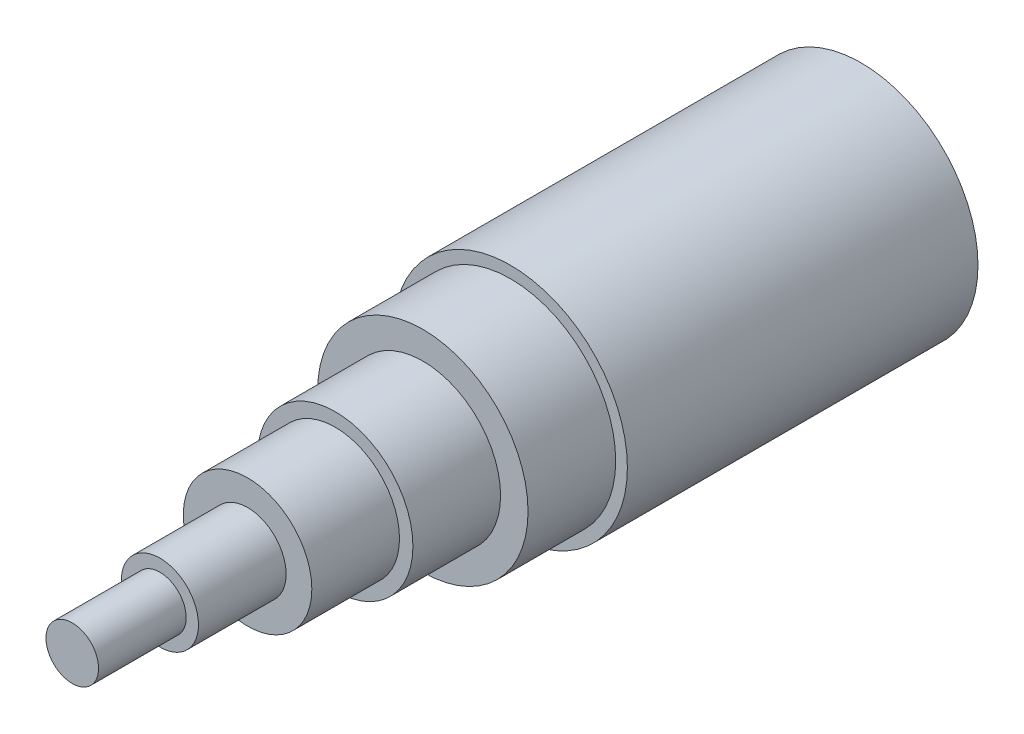
ISO-10303-21;
HEADER;
FILE_DESCRIPTION(('STEP AP214'),'2;1');
FILE_NAME('part.step','',(''),(''),'','','');
FILE_SCHEMA(('AUTOMOTIVE_DESIGN { 1 0 10303 214 1 1 1 1 }'));
ENDSEC;
DATA;
#1=APPLICATION_CONTEXT('core data for automotive mechanical design processes');
#2=APPLICATION_PROTOCOL_DEFINITION('international standard','automotive_design',2000,#1);
#3=PRODUCT_CONTEXT('',#1,'mechanical');
#4=PRODUCT('Part','Part','',(#3));
#5=PRODUCT_RELATED_PRODUCT_CATEGORY('part','',(#4));
#6=PRODUCT_DEFINITION_FORMATION('','',#4);
#7=PRODUCT_DEFINITION_CONTEXT('part definition',#1,'design');
#8=PRODUCT_DEFINITION('design','',#6,#7);
#9=PRODUCT_DEFINITION_SHAPE('','',#8);
#10=(LENGTH_UNIT() NAMED_UNIT(*) SI_UNIT(.MILLI.,.METRE.));
#11=(NAMED_UNIT(*) PLANE_ANGLE_UNIT() SI_UNIT($,.RADIAN.));
#12=(NAMED_UNIT(*) SI_UNIT($,.STERADIAN.) SOLID_ANGLE_UNIT());
#13=UNCERTAINTY_MEASURE_WITH_UNIT(LENGTH_MEASURE(1.E-05),#10,'distance_accuracy_value','');
#14=(GEOMETRIC_REPRESENTATION_CONTEXT(3) GLOBAL_UNCERTAINTY_ASSIGNED_CONTEXT((#13)) GLOBAL_UNIT_ASSIGNED_CONTEXT((#10,
#11,#12)) REPRESENTATION_CONTEXT('',''));
#15=CARTESIAN_POINT('',(0.,0.,0.));
#16=DIRECTION('',(0.,0.,1.));
#17=DIRECTION('',(1.,0.,0.));
#18=AXIS2_PLACEMENT_3D('',#15,#16,#17);
#19=CARTESIAN_POINT('',(0.,0.,6.));
#20=DIRECTION('',(0.,0.,-1.));
#21=DIRECTION('',(-1.,0.,0.));
#22=AXIS2_PLACEMENT_3D('',#19,#20,#21);
#23=CYLINDRICAL_SURFACE('',#22,0.33);
#24=CARTESIAN_POINT('',(0.,0.,5.25));
#25=DIRECTION('',(0.,0.,1.));
#26=DIRECTION('',(1.,0.,0.));
#27=AXIS2_PLACEMENT_3D('',#24,#25,#26);
#28=CIRCLE('',#27,0.33);
#29=CARTESIAN_POINT('',(0.33,0.,5.25));
#30=VERTEX_POINT('',#29);
#31=EDGE_CURVE('E65',#30,#30,#28,.T.);
#32=ORIENTED_EDGE('',*,*,#31,.T.);
#33=EDGE_LOOP('',(#32));
#34=FACE_BOUND('',#33,.T.);
#35=CARTESIAN_POINT('',(0.,0.,6.));
#36=DIRECTION('',(0.,0.,1.));
#37=DIRECTION('',(1.,0.,0.));
#38=AXIS2_PLACEMENT_3D('',#35,#36,#37);
#39=CIRCLE('',#38,0.33);
#40=CARTESIAN_POINT('',(0.33,0.,6.));
#41=VERTEX_POINT('',#40);
#42=EDGE_CURVE('E52',#41,#41,#39,.T.);
#43=ORIENTED_EDGE('',*,*,#42,.F.);
#44=EDGE_LOOP('',(#43));
#45=FACE_BOUND('',#44,.T.);
#46=ADVANCED_FACE('F39',(#34,#45),#23,.T.);
#47=CARTESIAN_POINT('',(0.,0.,6.));
#48=DIRECTION('',(0.,0.,1.));
#49=DIRECTION('',(1.,0.,0.));
#50=AXIS2_PLACEMENT_3D('',#47,#48,#49);
#51=PLANE('',#50);
#52=CARTESIAN_POINT('',(0.,0.,6.));
#53=DIRECTION('',(0.,0.,1.));
#54=DIRECTION('',(1.,0.,0.));
#55=AXIS2_PLACEMENT_3D('',#52,#53,#54);
#56=CIRCLE('',#55,0.225);
#57=CARTESIAN_POINT('',(0.225,0.,6.));
#58=VERTEX_POINT('',#57);
#59=EDGE_CURVE('E57',#58,#58,#56,.T.);
#60=ORIENTED_EDGE('',*,*,#59,.F.);
#61=EDGE_LOOP('',(#60));
#62=FACE_BOUND('',#61,.T.);
#63=ORIENTED_EDGE('',*,*,#42,.T.);
#64=EDGE_LOOP('',(#63));
#65=FACE_BOUND('',#64,.T.);
#66=ADVANCED_FACE('F110',(#62,#65),#51,.T.);
#67=CARTESIAN_POINT('',(0.,0.,5.25));
#68=DIRECTION('',(0.,0.,-1.));
#69=DIRECTION('',(-1.,0.,0.));
#70=AXIS2_PLACEMENT_3D('',#67,#68,#69);
#71=CYLINDRICAL_SURFACE('',#70,0.55);
#72=CARTESIAN_POINT('',(0.,0.,4.5));
#73=DIRECTION('',(0.,0.,1.));
#74=DIRECTION('',(1.,0.,0.));
#75=AXIS2_PLACEMENT_3D('',#72,#73,#74);
#76=CIRCLE('',#75,0.55);
#77=CARTESIAN_POINT('',(0.55,0.,4.5));
#78=VERTEX_POINT('',#77);
#79=EDGE_CURVE('E73',#78,#78,#76,.T.);
#80=ORIENTED_EDGE('',*,*,#79,.T.);
#81=EDGE_LOOP('',(#80));
#82=FACE_BOUND('',#81,.T.);
#83=CARTESIAN_POINT('',(0.,0.,5.25));
#84=DIRECTION('',(0.,0.,1.));
#85=DIRECTION('',(1.,0.,0.));
#86=AXIS2_PLACEMENT_3D('',#83,#84,#85);
#87=CIRCLE('',#86,0.55);
#88=CARTESIAN_POINT('',(0.55,0.,5.25));
#89=VERTEX_POINT('',#88);
#90=EDGE_CURVE('E61',#89,#89,#87,.T.);
#91=ORIENTED_EDGE('',*,*,#90,.F.);
#92=EDGE_LOOP('',(#91));
#93=FACE_BOUND('',#92,.T.);
#94=ADVANCED_FACE('F116',(#82,#93),#71,.T.);
#95=CARTESIAN_POINT('',(0.,0.,5.25));
#96=DIRECTION('',(0.,0.,1.));
#97=DIRECTION('',(1.,0.,0.));
#98=AXIS2_PLACEMENT_3D('',#95,#96,#97);
#99=PLANE('',#98);
#100=ORIENTED_EDGE('',*,*,#31,.F.);
#101=EDGE_LOOP('',(#100));
#102=FACE_BOUND('',#101,.T.);
#103=ORIENTED_EDGE('',*,*,#90,.T.);
#104=EDGE_LOOP('',(#103));
#105=FACE_BOUND('',#104,.T.);
#106=ADVANCED_FACE('F149',(#102,#105),#99,.T.);
#107=CARTESIAN_POINT('',(0.,0.,4.5));
#108=DIRECTION('',(0.,0.,-1.));
#109=DIRECTION('',(-1.,0.,0.));
#110=AXIS2_PLACEMENT_3D('',#107,#108,#109);
#111=CYLINDRICAL_SURFACE('',#110,0.665);
#112=CARTESIAN_POINT('',(0.,0.,3.75));
#113=DIRECTION('',(0.,0.,1.));
#114=DIRECTION('',(1.,0.,0.));
#115=AXIS2_PLACEMENT_3D('',#112,#113,#114);
#116=CIRCLE('',#115,0.665);
#117=CARTESIAN_POINT('',(0.665,0.,3.75));
#118=VERTEX_POINT('',#117);
#119=EDGE_CURVE('E82',#118,#118,#116,.T.);
#120=ORIENTED_EDGE('',*,*,#119,.T.);
#121=EDGE_LOOP('',(#120));
#122=FACE_BOUND('',#121,.T.);
#123=CARTESIAN_POINT('',(0.,0.,4.5));
#124=DIRECTION('',(0.,0.,1.));
#125=DIRECTION('',(1.,0.,0.));
#126=AXIS2_PLACEMENT_3D('',#123,#124,#125);
#127=CIRCLE('',#126,0.665);
#128=CARTESIAN_POINT('',(0.665,0.,4.5));
#129=VERTEX_POINT('',#128);
#130=EDGE_CURVE('E69',#129,#129,#127,.T.);
#131=ORIENTED_EDGE('',*,*,#130,.F.);
#132=EDGE_LOOP('',(#131));
#133=FACE_BOUND('',#132,.T.);
#134=ADVANCED_FACE('F145',(#122,#133),#111,.T.);
#135=CARTESIAN_POINT('',(0.,0.,4.5));
#136=DIRECTION('',(0.,0.,1.));
#137=DIRECTION('',(1.,0.,0.));
#138=AXIS2_PLACEMENT_3D('',#135,#136,#137);
#139=PLANE('',#138);
#140=ORIENTED_EDGE('',*,*,#79,.F.);
#141=EDGE_LOOP('',(#140));
#142=FACE_BOUND('',#141,.T.);
#143=ORIENTED_EDGE('',*,*,#130,.T.);
#144=EDGE_LOOP('',(#143));
#145=FACE_BOUND('',#144,.T.);
#146=ADVANCED_FACE('F137',(#142,#145),#139,.T.);
#147=CARTESIAN_POINT('',(0.,0.,3.75));
#148=DIRECTION('',(0.,0.,-1.));
#149=DIRECTION('',(-1.,0.,0.));
#150=AXIS2_PLACEMENT_3D('',#147,#148,#149);
#151=CYLINDRICAL_SURFACE('',#150,0.9);
#152=CARTESIAN_POINT('',(0.,0.,3.75));
#153=DIRECTION('',(0.,0.,1.));
#154=DIRECTION('',(1.,0.,0.));
#155=AXIS2_PLACEMENT_3D('',#152,#153,#154);
#156=CIRCLE('',#155,0.9);
#157=CARTESIAN_POINT('',(0.9,0.,3.75));
#158=VERTEX_POINT('',#157);
#159=EDGE_CURVE('E77',#158,#158,#156,.T.);
#160=ORIENTED_EDGE('',*,*,#159,.F.);
#161=EDGE_LOOP('',(#160));
#162=FACE_BOUND('',#161,.T.);
#163=CARTESIAN_POINT('',(0.,0.,3.));
#164=DIRECTION('',(0.,0.,1.));
#165=DIRECTION('',(1.,0.,0.));
#166=AXIS2_PLACEMENT_3D('',#163,#164,#165);
#167=CIRCLE('',#166,0.9);
#168=CARTESIAN_POINT('',(0.9,0.,3.));
#169=VERTEX_POINT('',#168);
#170=EDGE_CURVE('E78',#169,#169,#167,.T.);
#171=ORIENTED_EDGE('',*,*,#170,.T.);
#172=EDGE_LOOP('',(#171));
#173=FACE_BOUND('',#172,.T.);
#174=ADVANCED_FACE('F130',(#162,#173),#151,.T.);
#175=CARTESIAN_POINT('',(0.,0.,3.75));
#176=DIRECTION('',(0.,0.,1.));
#177=DIRECTION('',(1.,0.,0.));
#178=AXIS2_PLACEMENT_3D('',#175,#176,#177);
#179=PLANE('',#178);
#180=ORIENTED_EDGE('',*,*,#119,.F.);
#181=EDGE_LOOP('',(#180));
#182=FACE_BOUND('',#181,.T.);
#183=ORIENTED_EDGE('',*,*,#159,.T.);
#184=EDGE_LOOP('',(#183));
#185=FACE_BOUND('',#184,.T.);
#186=ADVANCED_FACE('F123',(#182,#185),#179,.T.);
#187=CARTESIAN_POINT('',(0.,0.,0.));
#188=DIRECTION('',(0.,0.,1.));
#189=DIRECTION('',(1.,0.,0.));
#190=AXIS2_PLACEMENT_3D('',#187,#188,#189);
#191=PLANE('',#190);
#192=CARTESIAN_POINT('',(0.,0.,0.));
#193=DIRECTION('',(0.,0.,1.));
#194=DIRECTION('',(1.,0.,0.));
#195=AXIS2_PLACEMENT_3D('',#192,#193,#194);
#196=CIRCLE('',#195,1.);
#197=CARTESIAN_POINT('',(1.,0.,0.));
#198=VERTEX_POINT('',#197);
#199=EDGE_CURVE('E43',#198,#198,#196,.T.);
#200=ORIENTED_EDGE('',*,*,#199,.F.);
#201=EDGE_LOOP('',(#200));
#202=FACE_BOUND('',#201,.T.);
#203=ADVANCED_FACE('F121',(#202),#191,.F.);
#204=CARTESIAN_POINT('',(0.,0.,3.));
#205=DIRECTION('',(0.,0.,-1.));
#206=DIRECTION('',(-1.,0.,0.));
#207=AXIS2_PLACEMENT_3D('',#204,#205,#206);
#208=CYLINDRICAL_SURFACE('',#207,1.);
#209=CARTESIAN_POINT('',(0.,0.,3.));
#210=DIRECTION('',(0.,0.,1.));
#211=DIRECTION('',(1.,0.,0.));
#212=AXIS2_PLACEMENT_3D('',#209,#210,#211);
#213=CIRCLE('',#212,1.);
#214=CARTESIAN_POINT('',(1.,0.,3.));
#215=VERTEX_POINT('',#214);
#216=EDGE_CURVE('E10',#215,#215,#213,.T.);
#217=ORIENTED_EDGE('',*,*,#216,.F.);
#218=EDGE_LOOP('',(#217));
#219=FACE_BOUND('',#218,.T.);
#220=ORIENTED_EDGE('',*,*,#199,.T.);
#221=EDGE_LOOP('',(#220));
#222=FACE_BOUND('',#221,.T.);
#223=ADVANCED_FACE('F41',(#219,#222),#208,.T.);
#224=CARTESIAN_POINT('',(0.,0.,3.));
#225=DIRECTION('',(0.,0.,1.));
#226=DIRECTION('',(1.,0.,0.));
#227=AXIS2_PLACEMENT_3D('',#224,#225,#226);
#228=PLANE('',#227);
#229=ORIENTED_EDGE('',*,*,#170,.F.);
#230=EDGE_LOOP('',(#229));
#231=FACE_BOUND('',#230,.T.);
#232=ORIENTED_EDGE('',*,*,#216,.T.);
#233=EDGE_LOOP('',(#232));
#234=FACE_BOUND('',#233,.T.);
#235=ADVANCED_FACE('F98',(#231,#234),#228,.T.);
#236=CARTESIAN_POINT('',(0.,0.,6.75));
#237=DIRECTION('',(0.,0.,-1.));
#238=DIRECTION('',(-1.,0.,0.));
#239=AXIS2_PLACEMENT_3D('',#236,#237,#238);
#240=CYLINDRICAL_SURFACE('',#239,0.225);
#241=ORIENTED_EDGE('',*,*,#59,.T.);
#242=EDGE_LOOP('',(#241));
#243=FACE_BOUND('',#242,.T.);
#244=CARTESIAN_POINT('',(0.,0.,6.75));
#245=DIRECTION('',(0.,0.,1.));
#246=DIRECTION('',(1.,0.,0.));
#247=AXIS2_PLACEMENT_3D('',#244,#245,#246);
#248=CIRCLE('',#247,0.225);
#249=CARTESIAN_POINT('',(0.225,0.,6.75));
#250=VERTEX_POINT('',#249);
#251=EDGE_CURVE('E83',#250,#250,#248,.T.);
#252=ORIENTED_EDGE('',*,*,#251,.F.);
#253=EDGE_LOOP('',(#252));
#254=FACE_BOUND('',#253,.T.);
#255=ADVANCED_FACE('F96',(#243,#254),#240,.T.);
#256=CARTESIAN_POINT('',(0.,0.,6.75));
#257=DIRECTION('',(0.,0.,1.));
#258=DIRECTION('',(1.,0.,0.));
#259=AXIS2_PLACEMENT_3D('',#256,#257,#258);
#260=PLANE('',#259);
#261=ORIENTED_EDGE('',*,*,#251,.T.);
#262=EDGE_LOOP('',(#261));
#263=FACE_BOUND('',#262,.T.);
#264=ADVANCED_FACE('F94',(#263),#260,.T.);
#265=CLOSED_SHELL('',(#46,#66,#94,#106,#134,#146,#174,#186,#203,#223,#235,#255,#264));
#266=MANIFOLD_SOLID_BREP('B2',#265);
#267=ADVANCED_BREP_SHAPE_REPRESENTATION('',(#18,#266),#14);
#268=SHAPE_DEFINITION_REPRESENTATION(#9,#267);
ENDSEC;
END-ISO-10303-21;
